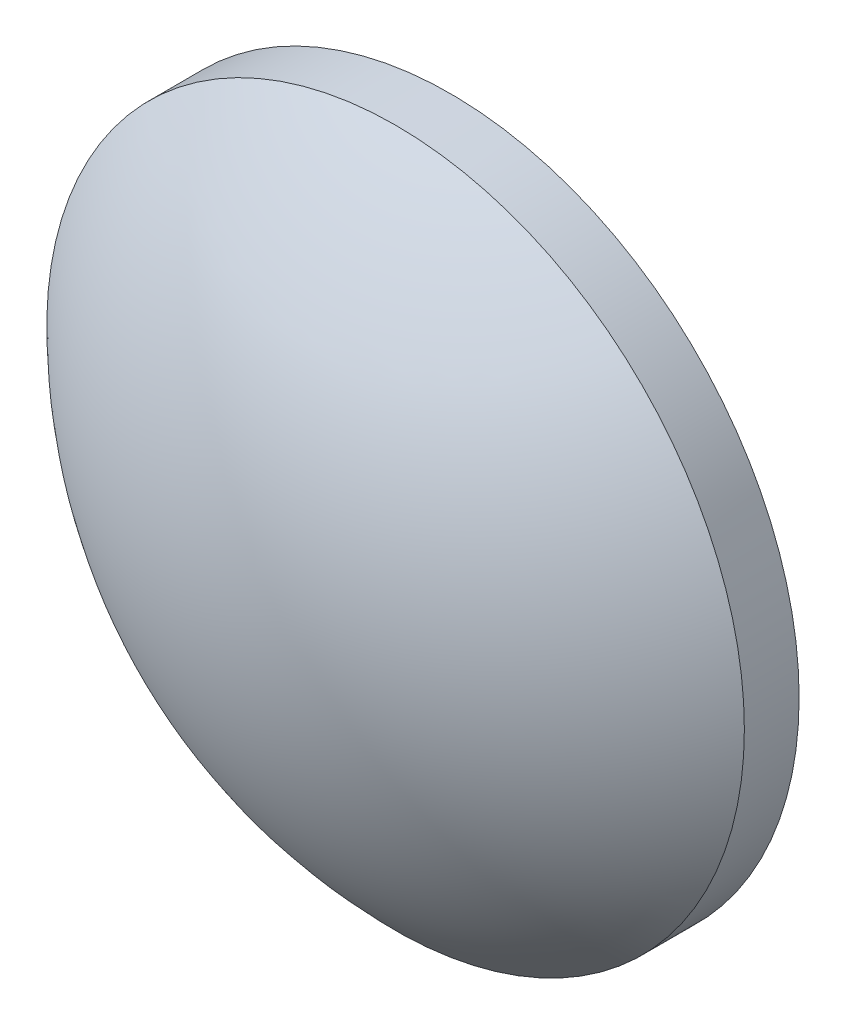
ISO-10303-21;
HEADER;
FILE_DESCRIPTION(('STEP AP214'),'2;1');
FILE_NAME('part.step','',(''),(''),'','','');
FILE_SCHEMA(('AUTOMOTIVE_DESIGN { 1 0 10303 214 1 1 1 1 }'));
ENDSEC;
DATA;
#1=APPLICATION_CONTEXT('core data for automotive mechanical design processes');
#2=APPLICATION_PROTOCOL_DEFINITION('international standard','automotive_design',2000,#1);
#3=PRODUCT_CONTEXT('',#1,'mechanical');
#4=PRODUCT('Part','Part','',(#3));
#5=PRODUCT_RELATED_PRODUCT_CATEGORY('part','',(#4));
#6=PRODUCT_DEFINITION_FORMATION('','',#4);
#7=PRODUCT_DEFINITION_CONTEXT('part definition',#1,'design');
#8=PRODUCT_DEFINITION('design','',#6,#7);
#9=PRODUCT_DEFINITION_SHAPE('','',#8);
#10=(LENGTH_UNIT() NAMED_UNIT(*) SI_UNIT(.MILLI.,.METRE.));
#11=(NAMED_UNIT(*) PLANE_ANGLE_UNIT() SI_UNIT($,.RADIAN.));
#12=(NAMED_UNIT(*) SI_UNIT($,.STERADIAN.) SOLID_ANGLE_UNIT());
#13=UNCERTAINTY_MEASURE_WITH_UNIT(LENGTH_MEASURE(1.E-05),#10,'distance_accuracy_value','');
#14=(GEOMETRIC_REPRESENTATION_CONTEXT(3) GLOBAL_UNCERTAINTY_ASSIGNED_CONTEXT((#13)) GLOBAL_UNIT_ASSIGNED_CONTEXT((#10,
#11,#12)) REPRESENTATION_CONTEXT('',''));
#15=CARTESIAN_POINT('',(0.,0.,0.));
#16=DIRECTION('',(0.,0.,1.));
#17=DIRECTION('',(1.,0.,0.));
#18=AXIS2_PLACEMENT_3D('',#15,#16,#17);
#19=CARTESIAN_POINT('',(0.,0.,-14.405));
#20=DIRECTION('',(0.,0.,1.));
#21=DIRECTION('',(0.,1.,0.));
#22=AXIS2_PLACEMENT_3D('',#19,#20,#21);
#23=SPHERICAL_SURFACE('',#22,18.02);
#24=CARTESIAN_POINT('',(0.,0.,-1.62101001251956));
#25=DIRECTION('',(0.,0.,1.));
#26=DIRECTION('',(1.,0.,0.));
#27=AXIS2_PLACEMENT_3D('',#24,#25,#26);
#28=CIRCLE('',#27,12.7);
#29=CARTESIAN_POINT('',(12.7,0.,-1.62101001251956));
#30=VERTEX_POINT('',#29);
#31=EDGE_CURVE('E8',#30,#30,#28,.T.);
#32=ORIENTED_EDGE('',*,*,#31,.T.);
#33=EDGE_LOOP('',(#32));
#34=FACE_BOUND('',#33,.T.);
#35=ADVANCED_FACE('F12',(#34),#23,.T.);
#36=CARTESIAN_POINT('',(0.,0.,4.30813204540037));
#37=DIRECTION('',(0.,0.,1.));
#38=DIRECTION('',(1.,0.,0.));
#39=AXIS2_PLACEMENT_3D('',#36,#37,#38);
#40=CYLINDRICAL_SURFACE('',#39,12.7);
#41=ORIENTED_EDGE('',*,*,#31,.F.);
#42=EDGE_LOOP('',(#41));
#43=FACE_BOUND('',#42,.T.);
#44=CARTESIAN_POINT('',(0.,0.,-3.615));
#45=DIRECTION('',(0.,0.,1.));
#46=DIRECTION('',(1.,0.,0.));
#47=AXIS2_PLACEMENT_3D('',#44,#45,#46);
#48=CIRCLE('',#47,12.7);
#49=CARTESIAN_POINT('',(12.7,0.,-3.615));
#50=VERTEX_POINT('',#49);
#51=EDGE_CURVE('E18',#50,#50,#48,.T.);
#52=ORIENTED_EDGE('',*,*,#51,.T.);
#53=EDGE_LOOP('',(#52));
#54=FACE_BOUND('',#53,.T.);
#55=ADVANCED_FACE('F24',(#43,#54),#40,.T.);
#56=CARTESIAN_POINT('',(0.,0.,-3.615));
#57=DIRECTION('',(0.,0.,1.));
#58=DIRECTION('',(1.,0.,0.));
#59=AXIS2_PLACEMENT_3D('',#56,#57,#58);
#60=PLANE('',#59);
#61=ORIENTED_EDGE('',*,*,#51,.F.);
#62=EDGE_LOOP('',(#61));
#63=FACE_BOUND('',#62,.T.);
#64=ADVANCED_FACE('F26',(#63),#60,.F.);
#65=CLOSED_SHELL('',(#35,#55,#64));
#66=MANIFOLD_SOLID_BREP('B1',#65);
#67=ADVANCED_BREP_SHAPE_REPRESENTATION('',(#18,#66),#14);
#68=SHAPE_DEFINITION_REPRESENTATION(#9,#67);
ENDSEC;
END-ISO-10303-21;
